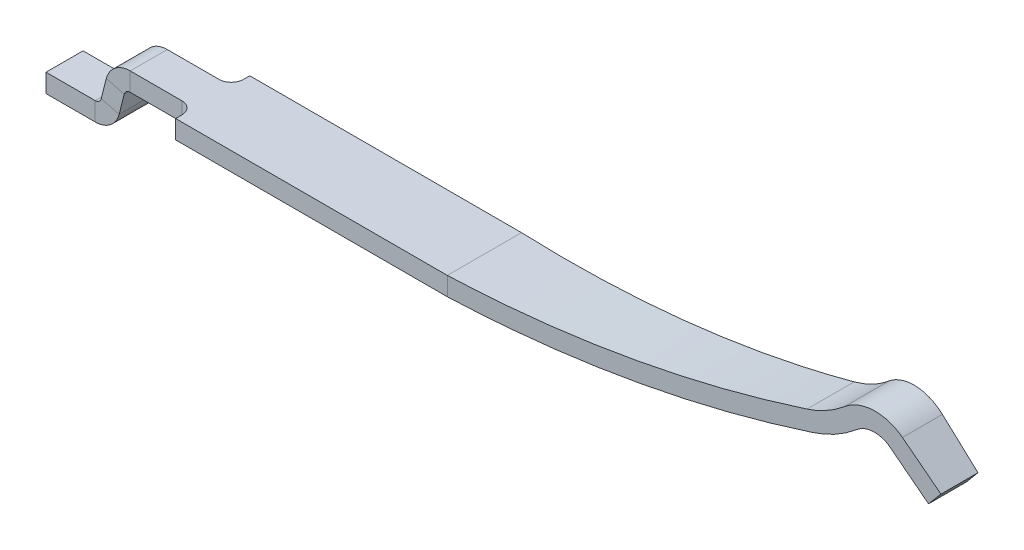
ISO-10303-21;
HEADER;
FILE_DESCRIPTION(('STEP AP214'),'2;1');
FILE_NAME('part.step','',(''),(''),'','','');
FILE_SCHEMA(('AUTOMOTIVE_DESIGN { 1 0 10303 214 1 1 1 1 }'));
ENDSEC;
DATA;
#1=APPLICATION_CONTEXT('core data for automotive mechanical design processes');
#2=APPLICATION_PROTOCOL_DEFINITION('international standard','automotive_design',2000,#1);
#3=PRODUCT_CONTEXT('',#1,'mechanical');
#4=PRODUCT('Part','Part','',(#3));
#5=PRODUCT_RELATED_PRODUCT_CATEGORY('part','',(#4));
#6=PRODUCT_DEFINITION_FORMATION('','',#4);
#7=PRODUCT_DEFINITION_CONTEXT('part definition',#1,'design');
#8=PRODUCT_DEFINITION('design','',#6,#7);
#9=PRODUCT_DEFINITION_SHAPE('','',#8);
#10=(LENGTH_UNIT() NAMED_UNIT(*) SI_UNIT(.MILLI.,.METRE.));
#11=(NAMED_UNIT(*) PLANE_ANGLE_UNIT() SI_UNIT($,.RADIAN.));
#12=(NAMED_UNIT(*) SI_UNIT($,.STERADIAN.) SOLID_ANGLE_UNIT());
#13=UNCERTAINTY_MEASURE_WITH_UNIT(LENGTH_MEASURE(1.E-05),#10,'distance_accuracy_value','');
#14=(GEOMETRIC_REPRESENTATION_CONTEXT(3) GLOBAL_UNCERTAINTY_ASSIGNED_CONTEXT((#13)) GLOBAL_UNIT_ASSIGNED_CONTEXT((#10,
#11,#12)) REPRESENTATION_CONTEXT('',''));
#15=CARTESIAN_POINT('',(0.,0.,0.));
#16=DIRECTION('',(0.,0.,1.));
#17=DIRECTION('',(1.,0.,0.));
#18=AXIS2_PLACEMENT_3D('',#15,#16,#17);
#19=CARTESIAN_POINT('',(0.,0.,0.));
#20=DIRECTION('',(1.,0.,0.));
#21=DIRECTION('',(0.,0.,-1.));
#22=AXIS2_PLACEMENT_3D('',#19,#20,#21);
#23=PLANE('',#22);
#24=DIRECTION('',(0.,0.,-1.));
#25=VECTOR('',#24,1.);
#26=CARTESIAN_POINT('',(0.,0.35,0.3));
#27=LINE('',#26,#25);
#28=CARTESIAN_POINT('',(0.,0.35,-0.25));
#29=VERTEX_POINT('',#28);
#30=CARTESIAN_POINT('',(0.,0.35,-0.3));
#31=VERTEX_POINT('',#30);
#32=EDGE_CURVE('E291',#29,#31,#27,.T.);
#33=ORIENTED_EDGE('',*,*,#32,.F.);
#34=DIRECTION('',(0.,1.,0.));
#35=VECTOR('',#34,1.);
#36=CARTESIAN_POINT('',(0.,0.,-0.25));
#37=LINE('',#36,#35);
#38=CARTESIAN_POINT('',(0.,0.5,-0.25));
#39=VERTEX_POINT('',#38);
#40=EDGE_CURVE('E317',#29,#39,#37,.T.);
#41=ORIENTED_EDGE('',*,*,#40,.T.);
#42=DIRECTION('',(0.,0.,-1.));
#43=VECTOR('',#42,1.);
#44=CARTESIAN_POINT('',(0.,0.5,0.3));
#45=LINE('',#44,#43);
#46=CARTESIAN_POINT('',(0.,0.5,-0.3));
#47=VERTEX_POINT('',#46);
#48=EDGE_CURVE('E299',#39,#47,#45,.T.);
#49=ORIENTED_EDGE('',*,*,#48,.T.);
#50=DIRECTION('',(0.,-1.,0.));
#51=VECTOR('',#50,1.);
#52=CARTESIAN_POINT('',(0.,0.5,-0.3));
#53=LINE('',#52,#51);
#54=EDGE_CURVE('E296',#47,#31,#53,.T.);
#55=ORIENTED_EDGE('',*,*,#54,.T.);
#56=EDGE_LOOP('',(#33,#41,#49,#55));
#57=FACE_BOUND('',#56,.T.);
#58=ADVANCED_FACE('F40',(#57),#23,.F.);
#59=CARTESIAN_POINT('',(1.7,0.5,0.3));
#60=DIRECTION('',(0.,0.,-1.));
#61=DIRECTION('',(0.,1.,0.));
#62=AXIS2_PLACEMENT_3D('',#59,#60,#61);
#63=PLANE('',#62);
#64=DIRECTION('',(0.,-1.,0.));
#65=VECTOR('',#64,1.);
#66=CARTESIAN_POINT('',(0.,0.5,0.3));
#67=LINE('',#66,#65);
#68=CARTESIAN_POINT('',(0.,0.5,0.3));
#69=VERTEX_POINT('',#68);
#70=CARTESIAN_POINT('',(0.,0.35,0.3));
#71=VERTEX_POINT('',#70);
#72=EDGE_CURVE('E288',#69,#71,#67,.T.);
#73=ORIENTED_EDGE('',*,*,#72,.T.);
#74=DIRECTION('',(-1.,0.,0.));
#75=VECTOR('',#74,1.);
#76=CARTESIAN_POINT('',(1.7,0.35,0.3));
#77=LINE('',#76,#75);
#78=CARTESIAN_POINT('',(2.2,0.35,0.3));
#79=VERTEX_POINT('',#78);
#80=EDGE_CURVE('E313',#79,#71,#77,.T.);
#81=ORIENTED_EDGE('',*,*,#80,.F.);
#82=DIRECTION('',(0.,-1.,0.));
#83=VECTOR('',#82,1.);
#84=CARTESIAN_POINT('',(2.2,0.5,0.3));
#85=LINE('',#84,#83);
#86=CARTESIAN_POINT('',(2.2,0.5,0.3));
#87=VERTEX_POINT('',#86);
#88=EDGE_CURVE('E492',#87,#79,#85,.T.);
#89=ORIENTED_EDGE('',*,*,#88,.F.);
#90=DIRECTION('',(-1.,0.,0.));
#91=VECTOR('',#90,1.);
#92=CARTESIAN_POINT('',(1.7,0.5,0.3));
#93=LINE('',#92,#91);
#94=EDGE_CURVE('E302',#87,#69,#93,.T.);
#95=ORIENTED_EDGE('',*,*,#94,.T.);
#96=EDGE_LOOP('',(#73,#81,#89,#95));
#97=FACE_BOUND('',#96,.T.);
#98=ADVANCED_FACE('F546',(#97),#63,.F.);
#99=CARTESIAN_POINT('',(1.7,0.35,0.3));
#100=DIRECTION('',(0.,1.,0.));
#101=DIRECTION('',(0.,0.,1.));
#102=AXIS2_PLACEMENT_3D('',#99,#100,#101);
#103=PLANE('',#102);
#104=CARTESIAN_POINT('',(0.,0.35,0.25));
#105=VERTEX_POINT('',#104);
#106=EDGE_CURVE('E293',#71,#105,#27,.T.);
#107=ORIENTED_EDGE('',*,*,#106,.T.);
#108=CARTESIAN_POINT('',(-0.1,0.35,0.25));
#109=DIRECTION('',(0.,1.,0.));
#110=DIRECTION('',(0.,0.,1.));
#111=AXIS2_PLACEMENT_3D('',#108,#109,#110);
#112=CIRCLE('',#111,0.1);
#113=CARTESIAN_POINT('',(-0.1,0.35,0.15));
#114=VERTEX_POINT('',#113);
#115=EDGE_CURVE('E392',#105,#114,#112,.T.);
#116=ORIENTED_EDGE('',*,*,#115,.T.);
#117=DIRECTION('',(1.,0.,0.));
#118=VECTOR('',#117,1.);
#119=CARTESIAN_POINT('',(-0.517954851978347,0.35,0.15));
#120=LINE('',#119,#118);
#121=CARTESIAN_POINT('',(-0.517954851978347,0.35,0.15));
#122=VERTEX_POINT('',#121);
#123=EDGE_CURVE('E323',#122,#114,#120,.T.);
#124=ORIENTED_EDGE('',*,*,#123,.F.);
#125=DIRECTION('',(0.,0.,1.));
#126=VECTOR('',#125,1.);
#127=CARTESIAN_POINT('',(-0.517954851978347,0.35,0.3));
#128=LINE('',#127,#126);
#129=CARTESIAN_POINT('',(-0.517954851978347,0.35,-0.15));
#130=VERTEX_POINT('',#129);
#131=EDGE_CURVE('E339',#122,#130,#128,.F.);
#132=ORIENTED_EDGE('',*,*,#131,.T.);
#133=DIRECTION('',(1.,0.,0.));
#134=VECTOR('',#133,1.);
#135=CARTESIAN_POINT('',(1.7,0.35,-0.15));
#136=LINE('',#135,#134);
#137=CARTESIAN_POINT('',(-0.1,0.35,-0.15));
#138=VERTEX_POINT('',#137);
#139=EDGE_CURVE('E326',#130,#138,#136,.T.);
#140=ORIENTED_EDGE('',*,*,#139,.T.);
#141=CARTESIAN_POINT('',(-0.1,0.35,-0.25));
#142=DIRECTION('',(0.,1.,0.));
#143=DIRECTION('',(0.,0.,1.));
#144=AXIS2_PLACEMENT_3D('',#141,#142,#143);
#145=CIRCLE('',#144,0.1);
#146=EDGE_CURVE('E390',#138,#29,#145,.T.);
#147=ORIENTED_EDGE('',*,*,#146,.T.);
#148=ORIENTED_EDGE('',*,*,#32,.T.);
#149=DIRECTION('',(-1.,0.,0.));
#150=VECTOR('',#149,1.);
#151=CARTESIAN_POINT('',(1.7,0.35,-0.3));
#152=LINE('',#151,#150);
#153=CARTESIAN_POINT('',(2.2,0.35,-0.3));
#154=VERTEX_POINT('',#153);
#155=EDGE_CURVE('E309',#154,#31,#152,.T.);
#156=ORIENTED_EDGE('',*,*,#155,.F.);
#157=DIRECTION('',(0.,0.,-1.));
#158=VECTOR('',#157,1.);
#159=CARTESIAN_POINT('',(2.2,0.35,0.3));
#160=LINE('',#159,#158);
#161=EDGE_CURVE('E487',#79,#154,#160,.T.);
#162=ORIENTED_EDGE('',*,*,#161,.F.);
#163=ORIENTED_EDGE('',*,*,#80,.T.);
#164=EDGE_LOOP('',(#107,#116,#124,#132,#140,#147,#148,#156,#162,#163));
#165=FACE_BOUND('',#164,.T.);
#166=ADVANCED_FACE('F407',(#165),#103,.F.);
#167=CARTESIAN_POINT('',(1.7,0.5,-0.3));
#168=DIRECTION('',(0.,0.,-1.));
#169=DIRECTION('',(-1.,0.,0.));
#170=AXIS2_PLACEMENT_3D('',#167,#168,#169);
#171=PLANE('',#170);
#172=ORIENTED_EDGE('',*,*,#54,.F.);
#173=DIRECTION('',(-1.,0.,0.));
#174=VECTOR('',#173,1.);
#175=CARTESIAN_POINT('',(1.7,0.5,-0.3));
#176=LINE('',#175,#174);
#177=CARTESIAN_POINT('',(2.2,0.5,-0.3));
#178=VERTEX_POINT('',#177);
#179=EDGE_CURVE('E305',#178,#47,#176,.T.);
#180=ORIENTED_EDGE('',*,*,#179,.F.);
#181=DIRECTION('',(0.,1.,0.));
#182=VECTOR('',#181,1.);
#183=CARTESIAN_POINT('',(2.2,0.5,-0.3));
#184=LINE('',#183,#182);
#185=EDGE_CURVE('E483',#154,#178,#184,.T.);
#186=ORIENTED_EDGE('',*,*,#185,.F.);
#187=ORIENTED_EDGE('',*,*,#155,.T.);
#188=EDGE_LOOP('',(#172,#180,#186,#187));
#189=FACE_BOUND('',#188,.T.);
#190=ADVANCED_FACE('F481',(#189),#171,.T.);
#191=CARTESIAN_POINT('',(1.7,0.5,0.3));
#192=DIRECTION('',(0.,1.,0.));
#193=DIRECTION('',(0.,0.,1.));
#194=AXIS2_PLACEMENT_3D('',#191,#192,#193);
#195=PLANE('',#194);
#196=CARTESIAN_POINT('',(0.,0.5,0.25));
#197=VERTEX_POINT('',#196);
#198=EDGE_CURVE('E301',#69,#197,#45,.T.);
#199=ORIENTED_EDGE('',*,*,#198,.F.);
#200=ORIENTED_EDGE('',*,*,#94,.F.);
#201=DIRECTION('',(0.,0.,1.));
#202=VECTOR('',#201,1.);
#203=CARTESIAN_POINT('',(2.2,0.5,0.3));
#204=LINE('',#203,#202);
#205=EDGE_CURVE('E486',#178,#87,#204,.T.);
#206=ORIENTED_EDGE('',*,*,#205,.F.);
#207=ORIENTED_EDGE('',*,*,#179,.T.);
#208=ORIENTED_EDGE('',*,*,#48,.F.);
#209=CARTESIAN_POINT('',(-0.1,0.5,-0.25));
#210=DIRECTION('',(0.,1.,0.));
#211=DIRECTION('',(0.,0.,1.));
#212=AXIS2_PLACEMENT_3D('',#209,#210,#211);
#213=CIRCLE('',#212,0.1);
#214=CARTESIAN_POINT('',(-0.1,0.5,-0.15));
#215=VERTEX_POINT('',#214);
#216=EDGE_CURVE('E388',#39,#215,#213,.F.);
#217=ORIENTED_EDGE('',*,*,#216,.T.);
#218=DIRECTION('',(-1.,0.,0.));
#219=VECTOR('',#218,1.);
#220=CARTESIAN_POINT('',(-0.517954851978347,0.5,-0.15));
#221=LINE('',#220,#219);
#222=CARTESIAN_POINT('',(-0.517954851978347,0.5,-0.15));
#223=VERTEX_POINT('',#222);
#224=EDGE_CURVE('E292',#223,#215,#221,.F.);
#225=ORIENTED_EDGE('',*,*,#224,.F.);
#226=DIRECTION('',(0.,0.,1.));
#227=VECTOR('',#226,1.);
#228=CARTESIAN_POINT('',(-0.517954851978347,0.5,0.3));
#229=LINE('',#228,#227);
#230=CARTESIAN_POINT('',(-0.517954851978347,0.5,0.15));
#231=VERTEX_POINT('',#230);
#232=EDGE_CURVE('E254',#223,#231,#229,.T.);
#233=ORIENTED_EDGE('',*,*,#232,.T.);
#234=DIRECTION('',(1.,0.,0.));
#235=VECTOR('',#234,1.);
#236=CARTESIAN_POINT('',(1.7,0.5,0.15));
#237=LINE('',#236,#235);
#238=CARTESIAN_POINT('',(-0.1,0.5,0.15));
#239=VERTEX_POINT('',#238);
#240=EDGE_CURVE('E320',#231,#239,#237,.T.);
#241=ORIENTED_EDGE('',*,*,#240,.T.);
#242=CARTESIAN_POINT('',(-0.1,0.5,0.25));
#243=DIRECTION('',(0.,1.,0.));
#244=DIRECTION('',(0.,0.,1.));
#245=AXIS2_PLACEMENT_3D('',#242,#243,#244);
#246=CIRCLE('',#245,0.1);
#247=EDGE_CURVE('E217',#239,#197,#246,.F.);
#248=ORIENTED_EDGE('',*,*,#247,.T.);
#249=EDGE_LOOP('',(#199,#200,#206,#207,#208,#217,#225,#233,#241,#248));
#250=FACE_BOUND('',#249,.T.);
#251=ADVANCED_FACE('F398',(#250),#195,.T.);
#252=ORIENTED_EDGE('',*,*,#198,.T.);
#253=DIRECTION('',(0.,-1.,0.));
#254=VECTOR('',#253,1.);
#255=CARTESIAN_POINT('',(0.,0.,0.25));
#256=LINE('',#255,#254);
#257=EDGE_CURVE('E383',#197,#105,#256,.T.);
#258=ORIENTED_EDGE('',*,*,#257,.T.);
#259=ORIENTED_EDGE('',*,*,#106,.F.);
#260=ORIENTED_EDGE('',*,*,#72,.F.);
#261=EDGE_LOOP('',(#252,#258,#259,#260));
#262=FACE_BOUND('',#261,.T.);
#263=ADVANCED_FACE('F405',(#262),#23,.F.);
#264=CARTESIAN_POINT('',(-0.517954851978347,0.5,0.15));
#265=DIRECTION('',(0.,0.,1.));
#266=DIRECTION('',(0.,-1.,0.));
#267=AXIS2_PLACEMENT_3D('',#264,#265,#266);
#268=PLANE('',#267);
#269=ORIENTED_EDGE('',*,*,#123,.T.);
#270=DIRECTION('',(0.,-1.,0.));
#271=VECTOR('',#270,1.);
#272=CARTESIAN_POINT('',(-0.1,0.5,0.15));
#273=LINE('',#272,#271);
#274=EDGE_CURVE('E386',#114,#239,#273,.F.);
#275=ORIENTED_EDGE('',*,*,#274,.T.);
#276=ORIENTED_EDGE('',*,*,#240,.F.);
#277=DIRECTION('',(0.,-1.,0.));
#278=VECTOR('',#277,1.);
#279=CARTESIAN_POINT('',(-0.517954851978347,0.5,0.15));
#280=LINE('',#279,#278);
#281=EDGE_CURVE('E336',#231,#122,#280,.T.);
#282=ORIENTED_EDGE('',*,*,#281,.T.);
#283=EDGE_LOOP('',(#269,#275,#276,#282));
#284=FACE_BOUND('',#283,.T.);
#285=ADVANCED_FACE('F409',(#284),#268,.T.);
#286=CARTESIAN_POINT('',(-0.517954851978347,0.5,-0.15));
#287=DIRECTION('',(0.,0.,-1.));
#288=DIRECTION('',(-1.,0.,0.));
#289=AXIS2_PLACEMENT_3D('',#286,#287,#288);
#290=PLANE('',#289);
#291=ORIENTED_EDGE('',*,*,#224,.T.);
#292=DIRECTION('',(0.,1.,0.));
#293=VECTOR('',#292,1.);
#294=CARTESIAN_POINT('',(-0.1,0.5,-0.15));
#295=LINE('',#294,#293);
#296=EDGE_CURVE('E381',#215,#138,#295,.F.);
#297=ORIENTED_EDGE('',*,*,#296,.T.);
#298=ORIENTED_EDGE('',*,*,#139,.F.);
#299=DIRECTION('',(0.,1.,0.));
#300=VECTOR('',#299,1.);
#301=CARTESIAN_POINT('',(-0.517954851978347,0.5,-0.15));
#302=LINE('',#301,#300);
#303=EDGE_CURVE('E342',#130,#223,#302,.T.);
#304=ORIENTED_EDGE('',*,*,#303,.T.);
#305=EDGE_LOOP('',(#291,#297,#298,#304));
#306=FACE_BOUND('',#305,.T.);
#307=ADVANCED_FACE('F464',(#306),#290,.T.);
#308=CARTESIAN_POINT('',(-0.517954851978347,0.3,0.));
#309=DIRECTION('',(0.,0.,-1.));
#310=DIRECTION('',(-1.,0.,0.));
#311=AXIS2_PLACEMENT_3D('',#308,#309,#310);
#312=CYLINDRICAL_SURFACE('',#311,0.2);
#313=DIRECTION('',(0.,0.,-1.));
#314=VECTOR('',#313,1.);
#315=CARTESIAN_POINT('',(-0.711686668360144,0.349678801529522,0.));
#316=LINE('',#315,#314);
#317=CARTESIAN_POINT('',(-0.711686668360144,0.349678801529522,-0.15));
#318=VERTEX_POINT('',#317);
#319=CARTESIAN_POINT('',(-0.711686668360144,0.349678801529522,0.15));
#320=VERTEX_POINT('',#319);
#321=EDGE_CURVE('E260',#318,#320,#316,.F.);
#322=ORIENTED_EDGE('',*,*,#321,.T.);
#323=CARTESIAN_POINT('',(-0.517954851978347,0.3,0.15));
#324=DIRECTION('',(0.,0.,-1.));
#325=DIRECTION('',(-1.,0.,0.));
#326=AXIS2_PLACEMENT_3D('',#323,#324,#325);
#327=CIRCLE('',#326,0.2);
#328=EDGE_CURVE('E250',#320,#231,#327,.T.);
#329=ORIENTED_EDGE('',*,*,#328,.T.);
#330=ORIENTED_EDGE('',*,*,#232,.F.);
#331=CARTESIAN_POINT('',(-0.517954851978347,0.3,-0.15));
#332=DIRECTION('',(0.,0.,-1.));
#333=DIRECTION('',(-1.,0.,0.));
#334=AXIS2_PLACEMENT_3D('',#331,#332,#333);
#335=CIRCLE('',#334,0.2);
#336=EDGE_CURVE('E329',#318,#223,#335,.T.);
#337=ORIENTED_EDGE('',*,*,#336,.F.);
#338=EDGE_LOOP('',(#322,#329,#330,#337));
#339=FACE_BOUND('',#338,.T.);
#340=ADVANCED_FACE('F467',(#339),#312,.T.);
#341=CARTESIAN_POINT('',(-0.711686668360144,0.349678801529522,0.15));
#342=DIRECTION('',(0.,0.,1.));
#343=DIRECTION('',(1.,0.,0.));
#344=AXIS2_PLACEMENT_3D('',#341,#342,#343);
#345=PLANE('',#344);
#346=DIRECTION('',(0.968659081908986,-0.248394007647608,0.));
#347=VECTOR('',#346,1.);
#348=CARTESIAN_POINT('',(-0.711686668360144,0.349678801529522,0.15));
#349=LINE('',#348,#347);
#350=CARTESIAN_POINT('',(-0.566387806073796,0.31241970038238,0.15));
#351=VERTEX_POINT('',#350);
#352=EDGE_CURVE('E245',#320,#351,#349,.T.);
#353=ORIENTED_EDGE('',*,*,#352,.T.);
#354=CARTESIAN_POINT('',(-0.517954851978347,0.3,0.15));
#355=DIRECTION('',(0.,0.,-1.));
#356=DIRECTION('',(-1.,0.,0.));
#357=AXIS2_PLACEMENT_3D('',#354,#355,#356);
#358=CIRCLE('',#357,0.0499999999999999);
#359=EDGE_CURVE('E247',#351,#122,#358,.T.);
#360=ORIENTED_EDGE('',*,*,#359,.T.);
#361=ORIENTED_EDGE('',*,*,#281,.F.);
#362=ORIENTED_EDGE('',*,*,#328,.F.);
#363=EDGE_LOOP('',(#353,#360,#361,#362));
#364=FACE_BOUND('',#363,.T.);
#365=ADVANCED_FACE('F416',(#364),#345,.T.);
#366=CARTESIAN_POINT('',(-0.517954851978347,0.3,0.));
#367=DIRECTION('',(0.,0.,-1.));
#368=DIRECTION('',(-1.,0.,0.));
#369=AXIS2_PLACEMENT_3D('',#366,#367,#368);
#370=CYLINDRICAL_SURFACE('',#369,0.0499999999999999);
#371=DIRECTION('',(0.,0.,-1.));
#372=VECTOR('',#371,1.);
#373=CARTESIAN_POINT('',(-0.566387806073796,0.31241970038238,-0.15));
#374=LINE('',#373,#372);
#375=CARTESIAN_POINT('',(-0.566387806073796,0.31241970038238,-0.15));
#376=VERTEX_POINT('',#375);
#377=EDGE_CURVE('E242',#351,#376,#374,.T.);
#378=ORIENTED_EDGE('',*,*,#377,.T.);
#379=CARTESIAN_POINT('',(-0.517954851978347,0.3,-0.15));
#380=DIRECTION('',(0.,0.,-1.));
#381=DIRECTION('',(-1.,0.,0.));
#382=AXIS2_PLACEMENT_3D('',#379,#380,#381);
#383=CIRCLE('',#382,0.0499999999999999);
#384=EDGE_CURVE('E251',#376,#130,#383,.T.);
#385=ORIENTED_EDGE('',*,*,#384,.T.);
#386=ORIENTED_EDGE('',*,*,#131,.F.);
#387=ORIENTED_EDGE('',*,*,#359,.F.);
#388=EDGE_LOOP('',(#378,#385,#386,#387));
#389=FACE_BOUND('',#388,.T.);
#390=ADVANCED_FACE('F414',(#389),#370,.F.);
#391=CARTESIAN_POINT('',(-0.711686668360144,0.349678801529522,-0.15));
#392=DIRECTION('',(0.,0.,-1.));
#393=DIRECTION('',(-1.,0.,0.));
#394=AXIS2_PLACEMENT_3D('',#391,#392,#393);
#395=PLANE('',#394);
#396=DIRECTION('',(-0.968659081908986,0.248394007647608,0.));
#397=VECTOR('',#396,1.);
#398=CARTESIAN_POINT('',(-0.711686668360144,0.349678801529522,-0.15));
#399=LINE('',#398,#397);
#400=EDGE_CURVE('E246',#376,#318,#399,.T.);
#401=ORIENTED_EDGE('',*,*,#400,.T.);
#402=ORIENTED_EDGE('',*,*,#336,.T.);
#403=ORIENTED_EDGE('',*,*,#303,.F.);
#404=ORIENTED_EDGE('',*,*,#384,.F.);
#405=EDGE_LOOP('',(#401,#402,#403,#404));
#406=FACE_BOUND('',#405,.T.);
#407=ADVANCED_FACE('F461',(#406),#395,.T.);
#408=CARTESIAN_POINT('',(-0.753253714264694,0.18758029961762,-0.15));
#409=DIRECTION('',(-0.968659081908986,0.248394007647608,0.));
#410=DIRECTION('',(-0.248394007647608,-0.968659081908986,0.));
#411=AXIS2_PLACEMENT_3D('',#408,#409,#410);
#412=PLANE('',#411);
#413=DIRECTION('',(0.,0.,1.));
#414=VECTOR('',#413,1.);
#415=CARTESIAN_POINT('',(-0.753253714264694,0.18758029961762,-0.15));
#416=LINE('',#415,#414);
#417=CARTESIAN_POINT('',(-0.753253714264694,0.18758029961762,-0.15));
#418=VERTEX_POINT('',#417);
#419=CARTESIAN_POINT('',(-0.753253714264694,0.18758029961762,0.15));
#420=VERTEX_POINT('',#419);
#421=EDGE_CURVE('E357',#418,#420,#416,.T.);
#422=ORIENTED_EDGE('',*,*,#421,.T.);
#423=DIRECTION('',(-0.248394007647608,-0.968659081908986,0.));
#424=VECTOR('',#423,1.);
#425=CARTESIAN_POINT('',(-0.753253714264694,0.18758029961762,0.15));
#426=LINE('',#425,#424);
#427=EDGE_CURVE('E273',#420,#320,#426,.F.);
#428=ORIENTED_EDGE('',*,*,#427,.T.);
#429=ORIENTED_EDGE('',*,*,#321,.F.);
#430=DIRECTION('',(0.248394007647608,0.968659081908986,0.));
#431=VECTOR('',#430,1.);
#432=CARTESIAN_POINT('',(-0.753253714264694,0.18758029961762,-0.15));
#433=LINE('',#432,#431);
#434=EDGE_CURVE('E345',#418,#318,#433,.T.);
#435=ORIENTED_EDGE('',*,*,#434,.F.);
#436=EDGE_LOOP('',(#422,#428,#429,#435));
#437=FACE_BOUND('',#436,.T.);
#438=ADVANCED_FACE('F456',(#437),#412,.T.);
#439=CARTESIAN_POINT('',(-0.753253714264694,0.18758029961762,0.15));
#440=DIRECTION('',(0.,0.,1.));
#441=DIRECTION('',(1.,0.,0.));
#442=AXIS2_PLACEMENT_3D('',#439,#440,#441);
#443=PLANE('',#442);
#444=DIRECTION('',(0.968659081908986,-0.248394007647608,0.));
#445=VECTOR('',#444,1.);
#446=CARTESIAN_POINT('',(-0.753253714264694,0.18758029961762,0.15));
#447=LINE('',#446,#445);
#448=CARTESIAN_POINT('',(-0.607954851978346,0.150321198470478,0.15));
#449=VERTEX_POINT('',#448);
#450=EDGE_CURVE('E360',#420,#449,#447,.T.);
#451=ORIENTED_EDGE('',*,*,#450,.T.);
#452=DIRECTION('',(0.248394007647608,0.968659081908986,0.));
#453=VECTOR('',#452,1.);
#454=CARTESIAN_POINT('',(-0.607954851978346,0.150321198470478,0.15));
#455=LINE('',#454,#453);
#456=EDGE_CURVE('E270',#449,#351,#455,.T.);
#457=ORIENTED_EDGE('',*,*,#456,.T.);
#458=ORIENTED_EDGE('',*,*,#352,.F.);
#459=ORIENTED_EDGE('',*,*,#427,.F.);
#460=EDGE_LOOP('',(#451,#457,#458,#459));
#461=FACE_BOUND('',#460,.T.);
#462=ADVANCED_FACE('F423',(#461),#443,.T.);
#463=CARTESIAN_POINT('',(-0.607954851978346,0.150321198470478,-0.15));
#464=DIRECTION('',(0.968659081908986,-0.248394007647608,0.));
#465=DIRECTION('',(0.248394007647608,0.968659081908986,0.));
#466=AXIS2_PLACEMENT_3D('',#463,#464,#465);
#467=PLANE('',#466);
#468=DIRECTION('',(0.,0.,1.));
#469=VECTOR('',#468,1.);
#470=CARTESIAN_POINT('',(-0.607954851978346,0.150321198470478,-0.15));
#471=LINE('',#470,#469);
#472=CARTESIAN_POINT('',(-0.607954851978346,0.150321198470478,-0.15));
#473=VERTEX_POINT('',#472);
#474=EDGE_CURVE('E363',#449,#473,#471,.F.);
#475=ORIENTED_EDGE('',*,*,#474,.T.);
#476=DIRECTION('',(0.248394007647608,0.968659081908986,0.));
#477=VECTOR('',#476,1.);
#478=CARTESIAN_POINT('',(-0.607954851978346,0.150321198470478,-0.15));
#479=LINE('',#478,#477);
#480=EDGE_CURVE('E274',#473,#376,#479,.T.);
#481=ORIENTED_EDGE('',*,*,#480,.T.);
#482=ORIENTED_EDGE('',*,*,#377,.F.);
#483=ORIENTED_EDGE('',*,*,#456,.F.);
#484=EDGE_LOOP('',(#475,#481,#482,#483));
#485=FACE_BOUND('',#484,.T.);
#486=ADVANCED_FACE('F421',(#485),#467,.T.);
#487=CARTESIAN_POINT('',(-0.753253714264694,0.18758029961762,-0.15));
#488=DIRECTION('',(0.,0.,-1.));
#489=DIRECTION('',(-1.,0.,0.));
#490=AXIS2_PLACEMENT_3D('',#487,#488,#489);
#491=PLANE('',#490);
#492=DIRECTION('',(-0.968659081908986,0.248394007647608,0.));
#493=VECTOR('',#492,1.);
#494=CARTESIAN_POINT('',(-0.607954851978346,0.150321198470478,-0.15));
#495=LINE('',#494,#493);
#496=EDGE_CURVE('E287',#473,#418,#495,.T.);
#497=ORIENTED_EDGE('',*,*,#496,.T.);
#498=ORIENTED_EDGE('',*,*,#434,.T.);
#499=ORIENTED_EDGE('',*,*,#400,.F.);
#500=ORIENTED_EDGE('',*,*,#480,.F.);
#501=EDGE_LOOP('',(#497,#498,#499,#500));
#502=FACE_BOUND('',#501,.T.);
#503=ADVANCED_FACE('F459',(#502),#491,.T.);
#504=CARTESIAN_POINT('',(-0.801686668360144,0.2,0.));
#505=DIRECTION('',(0.,0.,1.));
#506=DIRECTION('',(1.,0.,0.));
#507=AXIS2_PLACEMENT_3D('',#504,#505,#506);
#508=CYLINDRICAL_SURFACE('',#507,0.0500000000000001);
#509=DIRECTION('',(0.,0.,1.));
#510=VECTOR('',#509,1.);
#511=CARTESIAN_POINT('',(-0.801686668360144,0.15,-0.15));
#512=LINE('',#511,#510);
#513=CARTESIAN_POINT('',(-0.801686668360144,0.15,-0.15));
#514=VERTEX_POINT('',#513);
#515=CARTESIAN_POINT('',(-0.801686668360144,0.15,0.15));
#516=VERTEX_POINT('',#515);
#517=EDGE_CURVE('E237',#514,#516,#512,.T.);
#518=ORIENTED_EDGE('',*,*,#517,.T.);
#519=CARTESIAN_POINT('',(-0.801686668360144,0.2,0.15));
#520=DIRECTION('',(0.,0.,1.));
#521=DIRECTION('',(1.,0.,0.));
#522=AXIS2_PLACEMENT_3D('',#519,#520,#521);
#523=CIRCLE('',#522,0.0500000000000001);
#524=EDGE_CURVE('E263',#516,#420,#523,.T.);
#525=ORIENTED_EDGE('',*,*,#524,.T.);
#526=ORIENTED_EDGE('',*,*,#421,.F.);
#527=CARTESIAN_POINT('',(-0.801686668360144,0.2,-0.15));
#528=DIRECTION('',(0.,0.,1.));
#529=DIRECTION('',(1.,0.,0.));
#530=AXIS2_PLACEMENT_3D('',#527,#528,#529);
#531=CIRCLE('',#530,0.0500000000000001);
#532=EDGE_CURVE('E257',#514,#418,#531,.T.);
#533=ORIENTED_EDGE('',*,*,#532,.F.);
#534=EDGE_LOOP('',(#518,#525,#526,#533));
#535=FACE_BOUND('',#534,.T.);
#536=ADVANCED_FACE('F453',(#535),#508,.F.);
#537=CARTESIAN_POINT('',(-0.801686668360144,0.15,0.15));
#538=DIRECTION('',(0.,0.,1.));
#539=DIRECTION('',(1.,0.,0.));
#540=AXIS2_PLACEMENT_3D('',#537,#538,#539);
#541=PLANE('',#540);
#542=DIRECTION('',(0.,-1.,0.));
#543=VECTOR('',#542,1.);
#544=CARTESIAN_POINT('',(-0.801686668360144,0.15,0.15));
#545=LINE('',#544,#543);
#546=CARTESIAN_POINT('',(-0.801686668360144,0.,0.15));
#547=VERTEX_POINT('',#546);
#548=EDGE_CURVE('E240',#516,#547,#545,.T.);
#549=ORIENTED_EDGE('',*,*,#548,.T.);
#550=CARTESIAN_POINT('',(-0.801686668360144,0.2,0.15));
#551=DIRECTION('',(0.,0.,1.));
#552=DIRECTION('',(1.,0.,0.));
#553=AXIS2_PLACEMENT_3D('',#550,#551,#552);
#554=CIRCLE('',#553,0.2);
#555=EDGE_CURVE('E266',#547,#449,#554,.T.);
#556=ORIENTED_EDGE('',*,*,#555,.T.);
#557=ORIENTED_EDGE('',*,*,#450,.F.);
#558=ORIENTED_EDGE('',*,*,#524,.F.);
#559=EDGE_LOOP('',(#549,#556,#557,#558));
#560=FACE_BOUND('',#559,.T.);
#561=ADVANCED_FACE('F430',(#560),#541,.T.);
#562=CARTESIAN_POINT('',(-0.801686668360144,0.2,0.));
#563=DIRECTION('',(0.,0.,1.));
#564=DIRECTION('',(1.,0.,0.));
#565=AXIS2_PLACEMENT_3D('',#562,#563,#564);
#566=CYLINDRICAL_SURFACE('',#565,0.2);
#567=DIRECTION('',(0.,0.,1.));
#568=VECTOR('',#567,1.);
#569=CARTESIAN_POINT('',(-0.801686668360144,0.,0.));
#570=LINE('',#569,#568);
#571=CARTESIAN_POINT('',(-0.801686668360144,0.,-0.15));
#572=VERTEX_POINT('',#571);
#573=EDGE_CURVE('E269',#547,#572,#570,.F.);
#574=ORIENTED_EDGE('',*,*,#573,.T.);
#575=CARTESIAN_POINT('',(-0.801686668360144,0.2,-0.15));
#576=DIRECTION('',(0.,0.,1.));
#577=DIRECTION('',(1.,0.,0.));
#578=AXIS2_PLACEMENT_3D('',#575,#576,#577);
#579=CIRCLE('',#578,0.2);
#580=EDGE_CURVE('E354',#572,#473,#579,.T.);
#581=ORIENTED_EDGE('',*,*,#580,.T.);
#582=ORIENTED_EDGE('',*,*,#474,.F.);
#583=ORIENTED_EDGE('',*,*,#555,.F.);
#584=EDGE_LOOP('',(#574,#581,#582,#583));
#585=FACE_BOUND('',#584,.T.);
#586=ADVANCED_FACE('F428',(#585),#566,.T.);
#587=CARTESIAN_POINT('',(-0.801686668360144,0.15,-0.15));
#588=DIRECTION('',(0.,0.,-1.));
#589=DIRECTION('',(-1.,0.,0.));
#590=AXIS2_PLACEMENT_3D('',#587,#588,#589);
#591=PLANE('',#590);
#592=DIRECTION('',(0.,1.,0.));
#593=VECTOR('',#592,1.);
#594=CARTESIAN_POINT('',(-0.801686668360144,0.15,-0.15));
#595=LINE('',#594,#593);
#596=EDGE_CURVE('E241',#572,#514,#595,.T.);
#597=ORIENTED_EDGE('',*,*,#596,.T.);
#598=ORIENTED_EDGE('',*,*,#532,.T.);
#599=ORIENTED_EDGE('',*,*,#496,.F.);
#600=ORIENTED_EDGE('',*,*,#580,.F.);
#601=EDGE_LOOP('',(#597,#598,#599,#600));
#602=FACE_BOUND('',#601,.T.);
#603=ADVANCED_FACE('F448',(#602),#591,.T.);
#604=CARTESIAN_POINT('',(-0.801686668360144,0.15,-0.15));
#605=DIRECTION('',(0.,0.,1.));
#606=DIRECTION('',(1.,0.,0.));
#607=AXIS2_PLACEMENT_3D('',#604,#605,#606);
#608=PLANE('',#607);
#609=DIRECTION('',(0.,1.,0.));
#610=VECTOR('',#609,1.);
#611=CARTESIAN_POINT('',(-1.2,0.15,-0.15));
#612=LINE('',#611,#610);
#613=CARTESIAN_POINT('',(-1.2,0.,-0.15));
#614=VERTEX_POINT('',#613);
#615=CARTESIAN_POINT('',(-1.2,0.15,-0.15));
#616=VERTEX_POINT('',#615);
#617=EDGE_CURVE('E228',#614,#616,#612,.T.);
#618=ORIENTED_EDGE('',*,*,#617,.T.);
#619=DIRECTION('',(-1.,0.,0.));
#620=VECTOR('',#619,1.);
#621=CARTESIAN_POINT('',(-0.801686668360144,0.15,-0.15));
#622=LINE('',#621,#620);
#623=EDGE_CURVE('E283',#514,#616,#622,.T.);
#624=ORIENTED_EDGE('',*,*,#623,.F.);
#625=ORIENTED_EDGE('',*,*,#596,.F.);
#626=DIRECTION('',(1.,0.,0.));
#627=VECTOR('',#626,1.);
#628=CARTESIAN_POINT('',(-0.801686668360144,0.,-0.15));
#629=LINE('',#628,#627);
#630=EDGE_CURVE('E370',#572,#614,#629,.F.);
#631=ORIENTED_EDGE('',*,*,#630,.T.);
#632=EDGE_LOOP('',(#618,#624,#625,#631));
#633=FACE_BOUND('',#632,.T.);
#634=ADVANCED_FACE('F445',(#633),#608,.F.);
#635=CARTESIAN_POINT('',(-0.801686668360144,0.15,-0.15));
#636=DIRECTION('',(0.,-1.,0.));
#637=DIRECTION('',(0.,0.,-1.));
#638=AXIS2_PLACEMENT_3D('',#635,#636,#637);
#639=PLANE('',#638);
#640=DIRECTION('',(0.,0.,-1.));
#641=VECTOR('',#640,1.);
#642=CARTESIAN_POINT('',(-1.2,0.15,-0.15));
#643=LINE('',#642,#641);
#644=CARTESIAN_POINT('',(-1.2,0.15,0.15));
#645=VERTEX_POINT('',#644);
#646=EDGE_CURVE('E232',#616,#645,#643,.F.);
#647=ORIENTED_EDGE('',*,*,#646,.T.);
#648=DIRECTION('',(-1.,0.,0.));
#649=VECTOR('',#648,1.);
#650=CARTESIAN_POINT('',(-0.801686668360144,0.15,0.15));
#651=LINE('',#650,#649);
#652=EDGE_CURVE('E280',#516,#645,#651,.T.);
#653=ORIENTED_EDGE('',*,*,#652,.F.);
#654=ORIENTED_EDGE('',*,*,#517,.F.);
#655=ORIENTED_EDGE('',*,*,#623,.T.);
#656=EDGE_LOOP('',(#647,#653,#654,#655));
#657=FACE_BOUND('',#656,.T.);
#658=ADVANCED_FACE('F451',(#657),#639,.F.);
#659=CARTESIAN_POINT('',(-0.801686668360144,0.15,0.15));
#660=DIRECTION('',(0.,0.,-1.));
#661=DIRECTION('',(0.,1.,0.));
#662=AXIS2_PLACEMENT_3D('',#659,#660,#661);
#663=PLANE('',#662);
#664=DIRECTION('',(0.,1.,0.));
#665=VECTOR('',#664,1.);
#666=CARTESIAN_POINT('',(-1.2,0.15,0.15));
#667=LINE('',#666,#665);
#668=CARTESIAN_POINT('',(-1.2,0.,0.15));
#669=VERTEX_POINT('',#668);
#670=EDGE_CURVE('E376',#645,#669,#667,.F.);
#671=ORIENTED_EDGE('',*,*,#670,.T.);
#672=DIRECTION('',(1.,0.,0.));
#673=VECTOR('',#672,1.);
#674=CARTESIAN_POINT('',(-0.801686668360144,0.,0.15));
#675=LINE('',#674,#673);
#676=EDGE_CURVE('E284',#547,#669,#675,.F.);
#677=ORIENTED_EDGE('',*,*,#676,.F.);
#678=ORIENTED_EDGE('',*,*,#548,.F.);
#679=ORIENTED_EDGE('',*,*,#652,.T.);
#680=EDGE_LOOP('',(#671,#677,#678,#679));
#681=FACE_BOUND('',#680,.T.);
#682=ADVANCED_FACE('F435',(#681),#663,.F.);
#683=CARTESIAN_POINT('',(-0.801686668360144,0.,-0.15));
#684=DIRECTION('',(0.,1.,0.));
#685=DIRECTION('',(0.,0.,1.));
#686=AXIS2_PLACEMENT_3D('',#683,#684,#685);
#687=PLANE('',#686);
#688=DIRECTION('',(0.,0.,1.));
#689=VECTOR('',#688,1.);
#690=CARTESIAN_POINT('',(-1.2,0.,-0.15));
#691=LINE('',#690,#689);
#692=EDGE_CURVE('E277',#669,#614,#691,.F.);
#693=ORIENTED_EDGE('',*,*,#692,.T.);
#694=ORIENTED_EDGE('',*,*,#630,.F.);
#695=ORIENTED_EDGE('',*,*,#573,.F.);
#696=ORIENTED_EDGE('',*,*,#676,.T.);
#697=EDGE_LOOP('',(#693,#694,#695,#696));
#698=FACE_BOUND('',#697,.T.);
#699=ADVANCED_FACE('F440',(#698),#687,.F.);
#700=CARTESIAN_POINT('',(-1.2,0.,0.));
#701=DIRECTION('',(-1.,0.,0.));
#702=DIRECTION('',(0.,0.,1.));
#703=AXIS2_PLACEMENT_3D('',#700,#701,#702);
#704=PLANE('',#703);
#705=ORIENTED_EDGE('',*,*,#617,.F.);
#706=ORIENTED_EDGE('',*,*,#692,.F.);
#707=ORIENTED_EDGE('',*,*,#670,.F.);
#708=ORIENTED_EDGE('',*,*,#646,.F.);
#709=EDGE_LOOP('',(#705,#706,#707,#708));
#710=FACE_BOUND('',#709,.T.);
#711=ADVANCED_FACE('F594',(#710),#704,.T.);
#712=CARTESIAN_POINT('',(-0.1,0.,-0.25));
#713=DIRECTION('',(0.,1.,0.));
#714=DIRECTION('',(0.,0.,1.));
#715=AXIS2_PLACEMENT_3D('',#712,#713,#714);
#716=CYLINDRICAL_SURFACE('',#715,0.1);
#717=ORIENTED_EDGE('',*,*,#146,.F.);
#718=ORIENTED_EDGE('',*,*,#296,.F.);
#719=ORIENTED_EDGE('',*,*,#216,.F.);
#720=ORIENTED_EDGE('',*,*,#40,.F.);
#721=EDGE_LOOP('',(#717,#718,#719,#720));
#722=FACE_BOUND('',#721,.T.);
#723=ADVANCED_FACE('F472',(#722),#716,.F.);
#724=CARTESIAN_POINT('',(-0.1,0.,0.25));
#725=DIRECTION('',(0.,-1.,0.));
#726=DIRECTION('',(0.,0.,-1.));
#727=AXIS2_PLACEMENT_3D('',#724,#725,#726);
#728=CYLINDRICAL_SURFACE('',#727,0.1);
#729=ORIENTED_EDGE('',*,*,#247,.F.);
#730=ORIENTED_EDGE('',*,*,#274,.F.);
#731=ORIENTED_EDGE('',*,*,#115,.F.);
#732=ORIENTED_EDGE('',*,*,#257,.F.);
#733=EDGE_LOOP('',(#729,#730,#731,#732));
#734=FACE_BOUND('',#733,.T.);
#735=ADVANCED_FACE('F42',(#734),#728,.F.);
#736=CARTESIAN_POINT('',(5.65,0.95291183461909,0.3));
#737=DIRECTION('',(-0.6445535438081,-0.764559173095464,0.));
#738=DIRECTION('',(0.764559173095464,-0.6445535438081,0.));
#739=AXIS2_PLACEMENT_3D('',#736,#737,#738);
#740=PLANE('',#739);
#741=DIRECTION('',(0.764219607542158,-0.644267276651234,-0.0298004645016205));
#742=VECTOR('',#741,1.);
#743=CARTESIAN_POINT('',(5.64693616648843,0.955494767133683,0.165587983015571));
#744=LINE('',#743,#742);
#745=CARTESIAN_POINT('',(5.65,0.95291183461909,0.165468509946705));
#746=VERTEX_POINT('',#745);
#747=CARTESIAN_POINT('',(5.95,0.699999999999997,0.153770119507289));
#748=VERTEX_POINT('',#747);
#749=EDGE_CURVE('E62',#746,#748,#744,.T.);
#750=ORIENTED_EDGE('',*,*,#749,.F.);
#751=DIRECTION('',(0.,0.,-1.));
#752=VECTOR('',#751,1.);
#753=CARTESIAN_POINT('',(5.65,0.95291183461909,0.3));
#754=LINE('',#753,#752);
#755=CARTESIAN_POINT('',(5.65,0.95291183461909,-0.165468509946705));
#756=VERTEX_POINT('',#755);
#757=EDGE_CURVE('E224',#746,#756,#754,.T.);
#758=ORIENTED_EDGE('',*,*,#757,.T.);
#759=DIRECTION('',(-0.764219607542158,0.644267276651234,-0.0298004645016205));
#760=VECTOR('',#759,1.);
#761=CARTESIAN_POINT('',(5.66060062606003,0.943975088669243,-0.165055142404864));
#762=LINE('',#761,#760);
#763=CARTESIAN_POINT('',(5.95,0.699999999999997,-0.153770119507289));
#764=VERTEX_POINT('',#763);
#765=EDGE_CURVE('E211',#764,#756,#762,.T.);
#766=ORIENTED_EDGE('',*,*,#765,.F.);
#767=DIRECTION('',(0.,0.,-1.));
#768=VECTOR('',#767,1.);
#769=CARTESIAN_POINT('',(5.95,0.699999999999997,0.3));
#770=LINE('',#769,#768);
#771=EDGE_CURVE('E222',#748,#764,#770,.T.);
#772=ORIENTED_EDGE('',*,*,#771,.F.);
#773=EDGE_LOOP('',(#750,#758,#766,#772));
#774=FACE_BOUND('',#773,.T.);
#775=ADVANCED_FACE('F221',(#774),#740,.T.);
#776=CARTESIAN_POINT('',(5.74668303157121,1.06759571058341,0.3));
#777=DIRECTION('',(0.6445535438081,0.764559173095464,0.));
#778=DIRECTION('',(-0.764559173095464,0.6445535438081,0.));
#779=AXIS2_PLACEMENT_3D('',#776,#777,#778);
#780=PLANE('',#779);
#781=DIRECTION('',(-0.764219607542158,0.644267276651234,0.0298004645016205));
#782=VECTOR('',#781,1.);
#783=CARTESIAN_POINT('',(5.74353333698367,1.07025102737216,0.161821211629584));
#784=LINE('',#783,#782);
#785=CARTESIAN_POINT('',(6.04668303157121,0.814683875964317,0.15));
#786=VERTEX_POINT('',#785);
#787=CARTESIAN_POINT('',(5.74668303157121,1.06759571058341,0.161698390439417));
#788=VERTEX_POINT('',#787);
#789=EDGE_CURVE('E513',#786,#788,#784,.T.);
#790=ORIENTED_EDGE('',*,*,#789,.F.);
#791=DIRECTION('',(0.,0.,1.));
#792=VECTOR('',#791,1.);
#793=CARTESIAN_POINT('',(6.04668303157121,0.814683875964317,0.3));
#794=LINE('',#793,#792);
#795=CARTESIAN_POINT('',(6.04668303157121,0.814683875964317,-0.15));
#796=VERTEX_POINT('',#795);
#797=EDGE_CURVE('E229',#796,#786,#794,.T.);
#798=ORIENTED_EDGE('',*,*,#797,.F.);
#799=DIRECTION('',(0.764219607542158,-0.644267276651234,0.0298004645016205));
#800=VECTOR('',#799,1.);
#801=CARTESIAN_POINT('',(5.75719779655527,1.05873134890772,-0.161288371018876));
#802=LINE('',#801,#800);
#803=CARTESIAN_POINT('',(5.74668303157121,1.06759571058341,-0.161698390439417));
#804=VERTEX_POINT('',#803);
#805=EDGE_CURVE('E55',#804,#796,#802,.T.);
#806=ORIENTED_EDGE('',*,*,#805,.F.);
#807=DIRECTION('',(0.,0.,1.));
#808=VECTOR('',#807,1.);
#809=CARTESIAN_POINT('',(5.74668303157121,1.06759571058341,0.3));
#810=LINE('',#809,#808);
#811=EDGE_CURVE('E507',#804,#788,#810,.T.);
#812=ORIENTED_EDGE('',*,*,#811,.T.);
#813=EDGE_LOOP('',(#790,#798,#806,#812));
#814=FACE_BOUND('',#813,.T.);
#815=ADVANCED_FACE('F512',(#814),#780,.T.);
#816=CARTESIAN_POINT('',(5.52108929123838,0.8,0.));
#817=DIRECTION('',(0.,0.,-1.));
#818=DIRECTION('',(-1.,0.,0.));
#819=AXIS2_PLACEMENT_3D('',#816,#817,#818);
#820=CYLINDRICAL_SURFACE('',#819,0.199999999999996);
#821=CARTESIAN_POINT('',(5.52108929123838,0.8,0.170495335956423));
#822=DIRECTION('',(-0.0389650213051027,0.,-0.999240575194329));
#823=DIRECTION('',(0.999240575194329,0.,-0.0389650213051027));
#824=AXIS2_PLACEMENT_3D('',#821,#822,#823);
#825=ELLIPSE('',#824,0.200152000394,0.199999999999996);
#826=CARTESIAN_POINT('',(5.39217858247676,0.95291183461909,0.175522161966141));
#827=VERTEX_POINT('',#826);
#828=EDGE_CURVE('E522',#827,#746,#825,.T.);
#829=ORIENTED_EDGE('',*,*,#828,.F.);
#830=DIRECTION('',(0.,0.,-1.));
#831=VECTOR('',#830,1.);
#832=CARTESIAN_POINT('',(5.39217858247676,0.95291183461909,0.3));
#833=LINE('',#832,#831);
#834=CARTESIAN_POINT('',(5.39217858247676,0.95291183461909,-0.175522161966141));
#835=VERTEX_POINT('',#834);
#836=EDGE_CURVE('E504',#827,#835,#833,.T.);
#837=ORIENTED_EDGE('',*,*,#836,.T.);
#838=CARTESIAN_POINT('',(5.52108929123838,0.8,-0.170495335956423));
#839=DIRECTION('',(-0.0389650213051028,0.,0.999240575194329));
#840=DIRECTION('',(-0.999240575194329,0.,-0.0389650213051028));
#841=AXIS2_PLACEMENT_3D('',#838,#839,#840);
#842=ELLIPSE('',#841,0.200152000394,0.199999999999996);
#843=EDGE_CURVE('E225',#756,#835,#842,.T.);
#844=ORIENTED_EDGE('',*,*,#843,.F.);
#845=ORIENTED_EDGE('',*,*,#757,.F.);
#846=EDGE_LOOP('',(#829,#837,#844,#845));
#847=FACE_BOUND('',#846,.T.);
#848=ADVANCED_FACE('F809',(#847),#820,.F.);
#849=CARTESIAN_POINT('',(5.52108929123838,0.8,0.));
#850=DIRECTION('',(0.,0.,-1.));
#851=DIRECTION('',(-1.,0.,0.));
#852=AXIS2_PLACEMENT_3D('',#849,#850,#851);
#853=CYLINDRICAL_SURFACE('',#852,0.349999999999997);
#854=DIRECTION('',(0.,0.,1.));
#855=VECTOR('',#854,1.);
#856=CARTESIAN_POINT('',(5.29549555090555,1.06759571058341,0.3));
#857=LINE('',#856,#855);
#858=CARTESIAN_POINT('',(5.29549555090555,1.06759571058341,-0.17929228147343));
#859=VERTEX_POINT('',#858);
#860=CARTESIAN_POINT('',(5.29549555090555,1.06759571058341,0.17929228147343));
#861=VERTEX_POINT('',#860);
#862=EDGE_CURVE('E501',#859,#861,#857,.T.);
#863=ORIENTED_EDGE('',*,*,#862,.T.);
#864=CARTESIAN_POINT('',(5.52108929123838,0.8,0.170495335956423));
#865=DIRECTION('',(-0.0389650213051027,0.,-0.999240575194329));
#866=DIRECTION('',(0.999240575194329,0.,-0.0389650213051027));
#867=AXIS2_PLACEMENT_3D('',#864,#865,#866);
#868=ELLIPSE('',#867,0.350266000689504,0.349999999999997);
#869=EDGE_CURVE('E520',#788,#861,#868,.F.);
#870=ORIENTED_EDGE('',*,*,#869,.F.);
#871=ORIENTED_EDGE('',*,*,#811,.F.);
#872=CARTESIAN_POINT('',(5.52108929123838,0.8,-0.170495335956423));
#873=DIRECTION('',(-0.0389650213051028,0.,0.999240575194329));
#874=DIRECTION('',(-0.999240575194329,0.,-0.0389650213051028));
#875=AXIS2_PLACEMENT_3D('',#872,#873,#874);
#876=ELLIPSE('',#875,0.350266000689504,0.349999999999997);
#877=EDGE_CURVE('E518',#859,#804,#876,.F.);
#878=ORIENTED_EDGE('',*,*,#877,.F.);
#879=EDGE_LOOP('',(#863,#870,#871,#878));
#880=FACE_BOUND('',#879,.T.);
#881=ADVANCED_FACE('F517',(#880),#853,.T.);
#882=CARTESIAN_POINT('',(4.77018809974276,1.69070706314698,0.));
#883=DIRECTION('',(0.,0.,1.));
#884=DIRECTION('',(1.,0.,0.));
#885=AXIS2_PLACEMENT_3D('',#882,#883,#884);
#886=CYLINDRICAL_SURFACE('',#885,0.96499427969817);
#887=CARTESIAN_POINT('',(4.77018809974276,1.69070706314698,0.19977645368822));
#888=DIRECTION('',(-0.0389650213051027,0.,-0.999240575194329));
#889=DIRECTION('',(-0.999240575194329,0.,0.0389650213051027));
#890=AXIS2_PLACEMENT_3D('',#887,#888,#889);
#891=ELLIPSE('',#890,0.965727677251798,0.96499427969817);
#892=CARTESIAN_POINT('',(5.04641321867504,0.766091660116593,0.189005156053407));
#893=VERTEX_POINT('',#892);
#894=EDGE_CURVE('E530',#893,#827,#891,.F.);
#895=ORIENTED_EDGE('',*,*,#894,.F.);
#896=DIRECTION('',(0.,0.,-1.));
#897=VECTOR('',#896,1.);
#898=CARTESIAN_POINT('',(5.04641321867504,0.766091660116593,0.3));
#899=LINE('',#898,#897);
#900=CARTESIAN_POINT('',(5.04641321867504,0.766091660116593,-0.189005156053407));
#901=VERTEX_POINT('',#900);
#902=EDGE_CURVE('E498',#893,#901,#899,.T.);
#903=ORIENTED_EDGE('',*,*,#902,.T.);
#904=CARTESIAN_POINT('',(4.77018809974276,1.69070706314698,-0.19977645368822));
#905=DIRECTION('',(-0.0389650213051028,0.,0.999240575194329));
#906=DIRECTION('',(0.999240575194329,0.,0.0389650213051028));
#907=AXIS2_PLACEMENT_3D('',#904,#905,#906);
#908=ELLIPSE('',#907,0.965727677251798,0.96499427969817);
#909=EDGE_CURVE('E558',#835,#901,#908,.F.);
#910=ORIENTED_EDGE('',*,*,#909,.F.);
#911=ORIENTED_EDGE('',*,*,#836,.F.);
#912=EDGE_LOOP('',(#895,#903,#910,#911));
#913=FACE_BOUND('',#912,.T.);
#914=ADVANCED_FACE('F565',(#913),#886,.T.);
#915=CARTESIAN_POINT('',(4.77018809974276,1.69070706314698,0.));
#916=DIRECTION('',(0.,0.,1.));
#917=DIRECTION('',(1.,0.,0.));
#918=AXIS2_PLACEMENT_3D('',#915,#916,#917);
#919=CYLINDRICAL_SURFACE('',#918,0.81499427969817);
#920=CARTESIAN_POINT('',(4.77018809974276,1.69070706314698,0.19977645368822));
#921=DIRECTION('',(-0.0389650213051027,0.,-0.999240575194329));
#922=DIRECTION('',(-0.999240575194329,0.,0.0389650213051027));
#923=AXIS2_PLACEMENT_3D('',#920,#921,#922);
#924=ELLIPSE('',#923,0.815613676956295,0.81499427969817);
#925=CARTESIAN_POINT('',(5.0034764171711,0.909815113584046,0.19067946094745));
#926=VERTEX_POINT('',#925);
#927=EDGE_CURVE('E524',#861,#926,#924,.T.);
#928=ORIENTED_EDGE('',*,*,#927,.F.);
#929=ORIENTED_EDGE('',*,*,#862,.F.);
#930=CARTESIAN_POINT('',(4.77018809974276,1.69070706314698,-0.19977645368822));
#931=DIRECTION('',(-0.0389650213051028,0.,0.999240575194329));
#932=DIRECTION('',(0.999240575194329,0.,0.0389650213051028));
#933=AXIS2_PLACEMENT_3D('',#930,#931,#932);
#934=ELLIPSE('',#933,0.815613676956295,0.81499427969817);
#935=CARTESIAN_POINT('',(5.0034764171711,0.909815113584046,-0.19067946094745));
#936=VERTEX_POINT('',#935);
#937=EDGE_CURVE('E552',#936,#859,#934,.T.);
#938=ORIENTED_EDGE('',*,*,#937,.F.);
#939=DIRECTION('',(0.,0.,1.));
#940=VECTOR('',#939,1.);
#941=CARTESIAN_POINT('',(5.0034764171711,0.909815113584046,0.3));
#942=LINE('',#941,#940);
#943=EDGE_CURVE('E490',#936,#926,#942,.T.);
#944=ORIENTED_EDGE('',*,*,#943,.T.);
#945=EDGE_LOOP('',(#928,#929,#938,#944));
#946=FACE_BOUND('',#945,.T.);
#947=ADVANCED_FACE('F563',(#946),#919,.F.);
#948=CARTESIAN_POINT('',(2.2,10.293963403097,0.));
#949=DIRECTION('',(0.,0.,1.));
#950=DIRECTION('',(1.,0.,0.));
#951=AXIS2_PLACEMENT_3D('',#948,#949,#950);
#952=CYLINDRICAL_SURFACE('',#951,9.94396340309702);
#953=CARTESIAN_POINT('',(2.2,10.293963403097,0.3));
#954=DIRECTION('',(-0.0389650213051027,0.,-0.999240575194329));
#955=DIRECTION('',(-0.999240575194329,0.,0.0389650213051027));
#956=AXIS2_PLACEMENT_3D('',#953,#954,#955);
#957=ELLIPSE('',#956,9.95152083487318,9.94396340309702);
#958=EDGE_CURVE('E534',#79,#893,#957,.F.);
#959=ORIENTED_EDGE('',*,*,#958,.F.);
#960=ORIENTED_EDGE('',*,*,#161,.T.);
#961=CARTESIAN_POINT('',(2.2,10.293963403097,-0.3));
#962=DIRECTION('',(-0.0389650213051028,0.,0.999240575194329));
#963=DIRECTION('',(0.999240575194329,0.,0.0389650213051028));
#964=AXIS2_PLACEMENT_3D('',#961,#962,#963);
#965=ELLIPSE('',#964,9.95152083487318,9.94396340309702);
#966=EDGE_CURVE('E554',#901,#154,#965,.F.);
#967=ORIENTED_EDGE('',*,*,#966,.F.);
#968=ORIENTED_EDGE('',*,*,#902,.F.);
#969=EDGE_LOOP('',(#959,#960,#967,#968));
#970=FACE_BOUND('',#969,.T.);
#971=ADVANCED_FACE('F544',(#970),#952,.T.);
#972=CARTESIAN_POINT('',(2.2,10.293963403097,0.));
#973=DIRECTION('',(0.,0.,1.));
#974=DIRECTION('',(1.,0.,0.));
#975=AXIS2_PLACEMENT_3D('',#972,#973,#974);
#976=CYLINDRICAL_SURFACE('',#975,9.79396340309702);
#977=CARTESIAN_POINT('',(2.2,10.293963403097,0.3));
#978=DIRECTION('',(-0.0389650213051027,0.,-0.999240575194329));
#979=DIRECTION('',(-0.999240575194329,0.,0.0389650213051027));
#980=AXIS2_PLACEMENT_3D('',#977,#978,#979);
#981=ELLIPSE('',#980,9.80140683457767,9.79396340309702);
#982=EDGE_CURVE('E532',#926,#87,#981,.T.);
#983=ORIENTED_EDGE('',*,*,#982,.F.);
#984=ORIENTED_EDGE('',*,*,#943,.F.);
#985=CARTESIAN_POINT('',(2.2,10.293963403097,-0.3));
#986=DIRECTION('',(-0.0389650213051028,0.,0.999240575194329));
#987=DIRECTION('',(0.999240575194329,0.,0.0389650213051028));
#988=AXIS2_PLACEMENT_3D('',#985,#986,#987);
#989=ELLIPSE('',#988,9.80140683457767,9.79396340309702);
#990=EDGE_CURVE('E550',#178,#936,#989,.T.);
#991=ORIENTED_EDGE('',*,*,#990,.F.);
#992=ORIENTED_EDGE('',*,*,#205,.T.);
#993=EDGE_LOOP('',(#983,#984,#991,#992));
#994=FACE_BOUND('',#993,.T.);
#995=ADVANCED_FACE('F548',(#994),#976,.F.);
#996=CARTESIAN_POINT('',(5.72440625966716,0.432404289416586,0.));
#997=DIRECTION('',(0.764559173095461,-0.644553543808104,0.));
#998=DIRECTION('',(0.,0.,-1.));
#999=AXIS2_PLACEMENT_3D('',#996,#997,#998);
#1000=PLANE('',#999);
#1001=DIRECTION('',(0.644350050086572,0.764317792076058,-0.0251261948852353));
#1002=VECTOR('',#1001,1.);
#1003=CARTESIAN_POINT('',(5.72703823100584,0.435526292002159,0.162464432263144));
#1004=LINE('',#1003,#1002);
#1005=EDGE_CURVE('E12',#748,#786,#1004,.T.);
#1006=ORIENTED_EDGE('',*,*,#1005,.F.);
#1007=ORIENTED_EDGE('',*,*,#771,.T.);
#1008=DIRECTION('',(-0.644350050086572,-0.764317792076058,-0.0251261948852353));
#1009=VECTOR('',#1008,1.);
#1010=CARTESIAN_POINT('',(5.72703823100584,0.435526292002159,-0.162464432263144));
#1011=LINE('',#1010,#1009);
#1012=EDGE_CURVE('E48',#796,#764,#1011,.T.);
#1013=ORIENTED_EDGE('',*,*,#1012,.F.);
#1014=ORIENTED_EDGE('',*,*,#797,.T.);
#1015=EDGE_LOOP('',(#1006,#1007,#1013,#1014));
#1016=FACE_BOUND('',#1015,.T.);
#1017=ADVANCED_FACE('F227',(#1016),#1000,.T.);
#1018=CARTESIAN_POINT('',(-1.2,1.15,-0.432581758313392));
#1019=DIRECTION('',(-0.0389650213051028,0.,0.999240575194329));
#1020=DIRECTION('',(0.999240575194329,0.,0.0389650213051028));
#1021=AXIS2_PLACEMENT_3D('',#1018,#1019,#1020);
#1022=PLANE('',#1021);
#1023=ORIENTED_EDGE('',*,*,#990,.T.);
#1024=ORIENTED_EDGE('',*,*,#937,.T.);
#1025=ORIENTED_EDGE('',*,*,#877,.T.);
#1026=ORIENTED_EDGE('',*,*,#805,.T.);
#1027=ORIENTED_EDGE('',*,*,#1012,.T.);
#1028=ORIENTED_EDGE('',*,*,#765,.T.);
#1029=ORIENTED_EDGE('',*,*,#843,.T.);
#1030=ORIENTED_EDGE('',*,*,#909,.T.);
#1031=ORIENTED_EDGE('',*,*,#966,.T.);
#1032=ORIENTED_EDGE('',*,*,#185,.T.);
#1033=EDGE_LOOP('',(#1023,#1024,#1025,#1026,#1027,#1028,#1029,#1030,#1031,#1032));
#1034=FACE_BOUND('',#1033,.T.);
#1035=ADVANCED_FACE('F210',(#1034),#1022,.F.);
#1036=CARTESIAN_POINT('',(6.04668303157121,1.15,0.15));
#1037=DIRECTION('',(-0.0389650213051027,0.,-0.999240575194329));
#1038=DIRECTION('',(-0.999240575194329,0.,0.0389650213051027));
#1039=AXIS2_PLACEMENT_3D('',#1036,#1037,#1038);
#1040=PLANE('',#1039);
#1041=ORIENTED_EDGE('',*,*,#958,.T.);
#1042=ORIENTED_EDGE('',*,*,#894,.T.);
#1043=ORIENTED_EDGE('',*,*,#828,.T.);
#1044=ORIENTED_EDGE('',*,*,#749,.T.);
#1045=ORIENTED_EDGE('',*,*,#1005,.T.);
#1046=ORIENTED_EDGE('',*,*,#789,.T.);
#1047=ORIENTED_EDGE('',*,*,#869,.T.);
#1048=ORIENTED_EDGE('',*,*,#927,.T.);
#1049=ORIENTED_EDGE('',*,*,#982,.T.);
#1050=ORIENTED_EDGE('',*,*,#88,.T.);
#1051=EDGE_LOOP('',(#1041,#1042,#1043,#1044,#1045,#1046,#1047,#1048,#1049,#1050));
#1052=FACE_BOUND('',#1051,.T.);
#1053=ADVANCED_FACE('F537',(#1052),#1040,.F.);
#1054=CLOSED_SHELL('',(#58,#98,#166,#190,#251,#263,#285,#307,#340,#365,#390,#407,#438,#462,#486,
#503,#536,#561,#586,#603,#634,#658,#682,#699,#711,#723,#735,#775,#815,#848,#881,#914,#947,#971,
#995,#1017,#1035,#1053));
#1055=MANIFOLD_SOLID_BREP('B2',#1054);
#1056=ADVANCED_BREP_SHAPE_REPRESENTATION('',(#18,#1055),#14);
#1057=SHAPE_DEFINITION_REPRESENTATION(#9,#1056);
ENDSEC;
END-ISO-10303-21;
